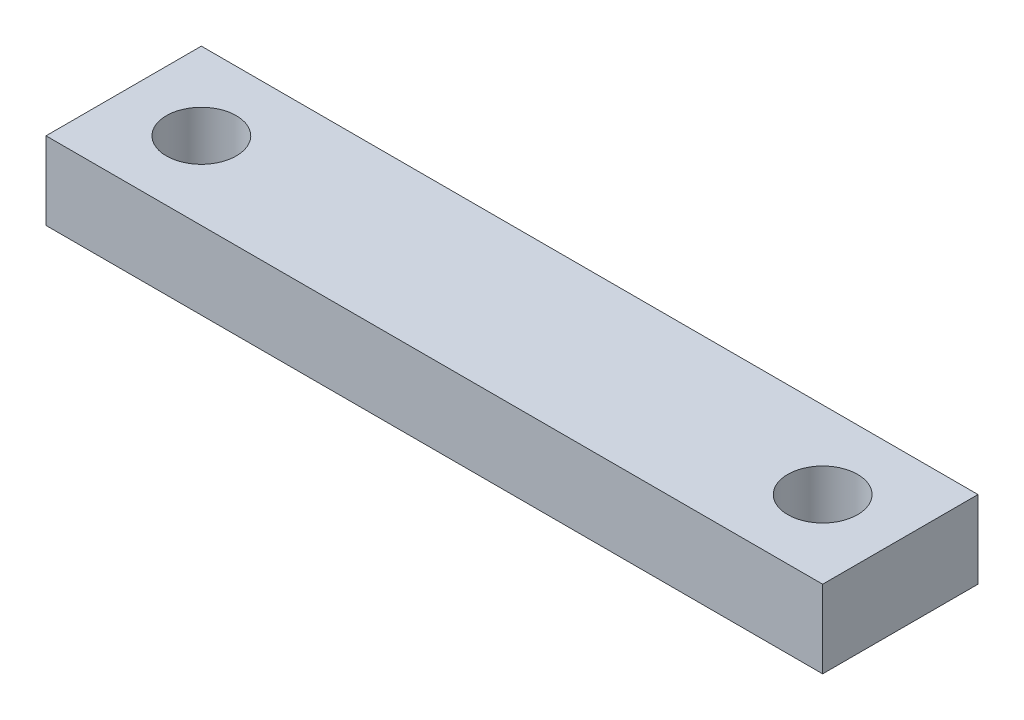
ISO-10303-21;
HEADER;
FILE_DESCRIPTION(('STEP AP214'),'2;1');
FILE_NAME('part.step','',(''),(''),'','','');
FILE_SCHEMA(('AUTOMOTIVE_DESIGN { 1 0 10303 214 1 1 1 1 }'));
ENDSEC;
DATA;
#1=APPLICATION_CONTEXT('core data for automotive mechanical design processes');
#2=APPLICATION_PROTOCOL_DEFINITION('international standard','automotive_design',2000,#1);
#3=PRODUCT_CONTEXT('',#1,'mechanical');
#4=PRODUCT('Part','Part','',(#3));
#5=PRODUCT_RELATED_PRODUCT_CATEGORY('part','',(#4));
#6=PRODUCT_DEFINITION_FORMATION('','',#4);
#7=PRODUCT_DEFINITION_CONTEXT('part definition',#1,'design');
#8=PRODUCT_DEFINITION('design','',#6,#7);
#9=PRODUCT_DEFINITION_SHAPE('','',#8);
#10=(LENGTH_UNIT() NAMED_UNIT(*) SI_UNIT(.MILLI.,.METRE.));
#11=(NAMED_UNIT(*) PLANE_ANGLE_UNIT() SI_UNIT($,.RADIAN.));
#12=(NAMED_UNIT(*) SI_UNIT($,.STERADIAN.) SOLID_ANGLE_UNIT());
#13=UNCERTAINTY_MEASURE_WITH_UNIT(LENGTH_MEASURE(1.E-05),#10,'distance_accuracy_value','');
#14=(GEOMETRIC_REPRESENTATION_CONTEXT(3) GLOBAL_UNCERTAINTY_ASSIGNED_CONTEXT((#13)) GLOBAL_UNIT_ASSIGNED_CONTEXT((#10,
#11,#12)) REPRESENTATION_CONTEXT('',''));
#15=CARTESIAN_POINT('',(0.,0.,0.));
#16=DIRECTION('',(0.,0.,1.));
#17=DIRECTION('',(1.,0.,0.));
#18=AXIS2_PLACEMENT_3D('',#15,#16,#17);
#19=CARTESIAN_POINT('',(0.,5.,0.));
#20=DIRECTION('',(0.,-1.,0.));
#21=DIRECTION('',(0.,0.,-1.));
#22=AXIS2_PLACEMENT_3D('',#19,#20,#21);
#23=PLANE('',#22);
#24=CARTESIAN_POINT('',(-20.,5.,0.));
#25=DIRECTION('',(0.,1.,0.));
#26=DIRECTION('',(0.,0.,1.));
#27=AXIS2_PLACEMENT_3D('',#24,#25,#26);
#28=CIRCLE('',#27,2.25);
#29=CARTESIAN_POINT('',(-20.,5.,2.25));
#30=VERTEX_POINT('',#29);
#31=EDGE_CURVE('E99',#30,#30,#28,.T.);
#32=ORIENTED_EDGE('',*,*,#31,.F.);
#33=EDGE_LOOP('',(#32));
#34=FACE_BOUND('',#33,.T.);
#35=DIRECTION('',(0.,0.,1.));
#36=VECTOR('',#35,1.);
#37=CARTESIAN_POINT('',(-25.,5.,5.));
#38=LINE('',#37,#36);
#39=CARTESIAN_POINT('',(-25.,5.,-5.));
#40=VERTEX_POINT('',#39);
#41=CARTESIAN_POINT('',(-25.,5.,5.));
#42=VERTEX_POINT('',#41);
#43=EDGE_CURVE('E84',#40,#42,#38,.T.);
#44=ORIENTED_EDGE('',*,*,#43,.T.);
#45=DIRECTION('',(1.,0.,0.));
#46=VECTOR('',#45,1.);
#47=CARTESIAN_POINT('',(-25.,5.,5.));
#48=LINE('',#47,#46);
#49=CARTESIAN_POINT('',(25.,5.,5.));
#50=VERTEX_POINT('',#49);
#51=EDGE_CURVE('E79',#42,#50,#48,.T.);
#52=ORIENTED_EDGE('',*,*,#51,.T.);
#53=DIRECTION('',(0.,0.,-1.));
#54=VECTOR('',#53,1.);
#55=CARTESIAN_POINT('',(25.,5.,5.));
#56=LINE('',#55,#54);
#57=CARTESIAN_POINT('',(25.,5.,-5.));
#58=VERTEX_POINT('',#57);
#59=EDGE_CURVE('E82',#50,#58,#56,.T.);
#60=ORIENTED_EDGE('',*,*,#59,.T.);
#61=DIRECTION('',(-1.,0.,0.));
#62=VECTOR('',#61,1.);
#63=CARTESIAN_POINT('',(-25.,5.,-5.));
#64=LINE('',#63,#62);
#65=EDGE_CURVE('E49',#58,#40,#64,.T.);
#66=ORIENTED_EDGE('',*,*,#65,.T.);
#67=EDGE_LOOP('',(#44,#52,#60,#66));
#68=FACE_BOUND('',#67,.T.);
#69=CARTESIAN_POINT('',(20.,5.,0.));
#70=DIRECTION('',(0.,1.,0.));
#71=DIRECTION('',(0.,0.,1.));
#72=AXIS2_PLACEMENT_3D('',#69,#70,#71);
#73=CIRCLE('',#72,2.25);
#74=CARTESIAN_POINT('',(20.,5.,2.25));
#75=VERTEX_POINT('',#74);
#76=EDGE_CURVE('E114',#75,#75,#73,.T.);
#77=ORIENTED_EDGE('',*,*,#76,.F.);
#78=EDGE_LOOP('',(#77));
#79=FACE_BOUND('',#78,.T.);
#80=ADVANCED_FACE('F32',(#34,#68,#79),#23,.F.);
#81=CARTESIAN_POINT('',(0.,0.,0.));
#82=DIRECTION('',(0.,-1.,0.));
#83=DIRECTION('',(0.,0.,-1.));
#84=AXIS2_PLACEMENT_3D('',#81,#82,#83);
#85=PLANE('',#84);
#86=CARTESIAN_POINT('',(-20.,0.,0.));
#87=DIRECTION('',(0.,1.,0.));
#88=DIRECTION('',(0.,0.,1.));
#89=AXIS2_PLACEMENT_3D('',#86,#87,#88);
#90=CIRCLE('',#89,2.25);
#91=CARTESIAN_POINT('',(-20.,0.,2.25));
#92=VERTEX_POINT('',#91);
#93=EDGE_CURVE('E111',#92,#92,#90,.T.);
#94=ORIENTED_EDGE('',*,*,#93,.T.);
#95=EDGE_LOOP('',(#94));
#96=FACE_BOUND('',#95,.T.);
#97=DIRECTION('',(0.,0.,1.));
#98=VECTOR('',#97,1.);
#99=CARTESIAN_POINT('',(-25.,0.,5.));
#100=LINE('',#99,#98);
#101=CARTESIAN_POINT('',(-25.,0.,-5.));
#102=VERTEX_POINT('',#101);
#103=CARTESIAN_POINT('',(-25.,0.,5.));
#104=VERTEX_POINT('',#103);
#105=EDGE_CURVE('E96',#102,#104,#100,.T.);
#106=ORIENTED_EDGE('',*,*,#105,.F.);
#107=DIRECTION('',(-1.,0.,0.));
#108=VECTOR('',#107,1.);
#109=CARTESIAN_POINT('',(-25.,0.,-5.));
#110=LINE('',#109,#108);
#111=CARTESIAN_POINT('',(25.,0.,-5.));
#112=VERTEX_POINT('',#111);
#113=EDGE_CURVE('E72',#112,#102,#110,.T.);
#114=ORIENTED_EDGE('',*,*,#113,.F.);
#115=DIRECTION('',(0.,0.,-1.));
#116=VECTOR('',#115,1.);
#117=CARTESIAN_POINT('',(25.,0.,5.));
#118=LINE('',#117,#116);
#119=CARTESIAN_POINT('',(25.,0.,5.));
#120=VERTEX_POINT('',#119);
#121=EDGE_CURVE('E66',#120,#112,#118,.T.);
#122=ORIENTED_EDGE('',*,*,#121,.F.);
#123=DIRECTION('',(1.,0.,0.));
#124=VECTOR('',#123,1.);
#125=CARTESIAN_POINT('',(-25.,0.,5.));
#126=LINE('',#125,#124);
#127=EDGE_CURVE('E88',#104,#120,#126,.T.);
#128=ORIENTED_EDGE('',*,*,#127,.F.);
#129=EDGE_LOOP('',(#106,#114,#122,#128));
#130=FACE_BOUND('',#129,.T.);
#131=CARTESIAN_POINT('',(20.,0.,0.));
#132=DIRECTION('',(0.,1.,0.));
#133=DIRECTION('',(0.,0.,1.));
#134=AXIS2_PLACEMENT_3D('',#131,#132,#133);
#135=CIRCLE('',#134,2.25);
#136=CARTESIAN_POINT('',(20.,0.,2.25));
#137=VERTEX_POINT('',#136);
#138=EDGE_CURVE('E117',#137,#137,#135,.T.);
#139=ORIENTED_EDGE('',*,*,#138,.T.);
#140=EDGE_LOOP('',(#139));
#141=FACE_BOUND('',#140,.T.);
#142=ADVANCED_FACE('F107',(#96,#130,#141),#85,.T.);
#143=CARTESIAN_POINT('',(-25.,5.,5.));
#144=DIRECTION('',(1.,0.,0.));
#145=DIRECTION('',(0.,0.,-1.));
#146=AXIS2_PLACEMENT_3D('',#143,#144,#145);
#147=PLANE('',#146);
#148=ORIENTED_EDGE('',*,*,#105,.T.);
#149=DIRECTION('',(0.,-1.,0.));
#150=VECTOR('',#149,1.);
#151=CARTESIAN_POINT('',(-25.,5.,5.));
#152=LINE('',#151,#150);
#153=EDGE_CURVE('E11',#42,#104,#152,.T.);
#154=ORIENTED_EDGE('',*,*,#153,.F.);
#155=ORIENTED_EDGE('',*,*,#43,.F.);
#156=DIRECTION('',(0.,-1.,0.));
#157=VECTOR('',#156,1.);
#158=CARTESIAN_POINT('',(-25.,5.,-5.));
#159=LINE('',#158,#157);
#160=EDGE_CURVE('E92',#40,#102,#159,.T.);
#161=ORIENTED_EDGE('',*,*,#160,.T.);
#162=EDGE_LOOP('',(#148,#154,#155,#161));
#163=FACE_BOUND('',#162,.T.);
#164=ADVANCED_FACE('F34',(#163),#147,.F.);
#165=CARTESIAN_POINT('',(-25.,5.,5.));
#166=DIRECTION('',(0.,0.,-1.));
#167=DIRECTION('',(-1.,0.,0.));
#168=AXIS2_PLACEMENT_3D('',#165,#166,#167);
#169=PLANE('',#168);
#170=ORIENTED_EDGE('',*,*,#127,.T.);
#171=DIRECTION('',(0.,-1.,0.));
#172=VECTOR('',#171,1.);
#173=CARTESIAN_POINT('',(25.,5.,5.));
#174=LINE('',#173,#172);
#175=EDGE_CURVE('E41',#50,#120,#174,.T.);
#176=ORIENTED_EDGE('',*,*,#175,.F.);
#177=ORIENTED_EDGE('',*,*,#51,.F.);
#178=ORIENTED_EDGE('',*,*,#153,.T.);
#179=EDGE_LOOP('',(#170,#176,#177,#178));
#180=FACE_BOUND('',#179,.T.);
#181=ADVANCED_FACE('F87',(#180),#169,.F.);
#182=CARTESIAN_POINT('',(25.,5.,5.));
#183=DIRECTION('',(-1.,0.,0.));
#184=DIRECTION('',(0.,0.,1.));
#185=AXIS2_PLACEMENT_3D('',#182,#183,#184);
#186=PLANE('',#185);
#187=ORIENTED_EDGE('',*,*,#121,.T.);
#188=DIRECTION('',(0.,-1.,0.));
#189=VECTOR('',#188,1.);
#190=CARTESIAN_POINT('',(25.,5.,-5.));
#191=LINE('',#190,#189);
#192=EDGE_CURVE('E89',#58,#112,#191,.T.);
#193=ORIENTED_EDGE('',*,*,#192,.F.);
#194=ORIENTED_EDGE('',*,*,#59,.F.);
#195=ORIENTED_EDGE('',*,*,#175,.T.);
#196=EDGE_LOOP('',(#187,#193,#194,#195));
#197=FACE_BOUND('',#196,.T.);
#198=ADVANCED_FACE('F90',(#197),#186,.F.);
#199=CARTESIAN_POINT('',(-25.,5.,-5.));
#200=DIRECTION('',(0.,0.,1.));
#201=DIRECTION('',(1.,0.,0.));
#202=AXIS2_PLACEMENT_3D('',#199,#200,#201);
#203=PLANE('',#202);
#204=ORIENTED_EDGE('',*,*,#113,.T.);
#205=ORIENTED_EDGE('',*,*,#160,.F.);
#206=ORIENTED_EDGE('',*,*,#65,.F.);
#207=ORIENTED_EDGE('',*,*,#192,.T.);
#208=EDGE_LOOP('',(#204,#205,#206,#207));
#209=FACE_BOUND('',#208,.T.);
#210=ADVANCED_FACE('F104',(#209),#203,.F.);
#211=CARTESIAN_POINT('',(-20.,5.,0.));
#212=DIRECTION('',(0.,-1.,0.));
#213=DIRECTION('',(0.,0.,-1.));
#214=AXIS2_PLACEMENT_3D('',#211,#212,#213);
#215=CYLINDRICAL_SURFACE('',#214,2.25);
#216=ORIENTED_EDGE('',*,*,#31,.T.);
#217=EDGE_LOOP('',(#216));
#218=FACE_BOUND('',#217,.T.);
#219=ORIENTED_EDGE('',*,*,#93,.F.);
#220=EDGE_LOOP('',(#219));
#221=FACE_BOUND('',#220,.T.);
#222=ADVANCED_FACE('F135',(#218,#221),#215,.F.);
#223=CARTESIAN_POINT('',(20.,5.,0.));
#224=DIRECTION('',(0.,-1.,0.));
#225=DIRECTION('',(0.,0.,-1.));
#226=AXIS2_PLACEMENT_3D('',#223,#224,#225);
#227=CYLINDRICAL_SURFACE('',#226,2.25);
#228=ORIENTED_EDGE('',*,*,#76,.T.);
#229=EDGE_LOOP('',(#228));
#230=FACE_BOUND('',#229,.T.);
#231=ORIENTED_EDGE('',*,*,#138,.F.);
#232=EDGE_LOOP('',(#231));
#233=FACE_BOUND('',#232,.T.);
#234=ADVANCED_FACE('F123',(#230,#233),#227,.F.);
#235=CLOSED_SHELL('',(#80,#142,#164,#181,#198,#210,#222,#234));
#236=MANIFOLD_SOLID_BREP('B2',#235);
#237=ADVANCED_BREP_SHAPE_REPRESENTATION('',(#18,#236),#14);
#238=SHAPE_DEFINITION_REPRESENTATION(#9,#237);
ENDSEC;
END-ISO-10303-21;
